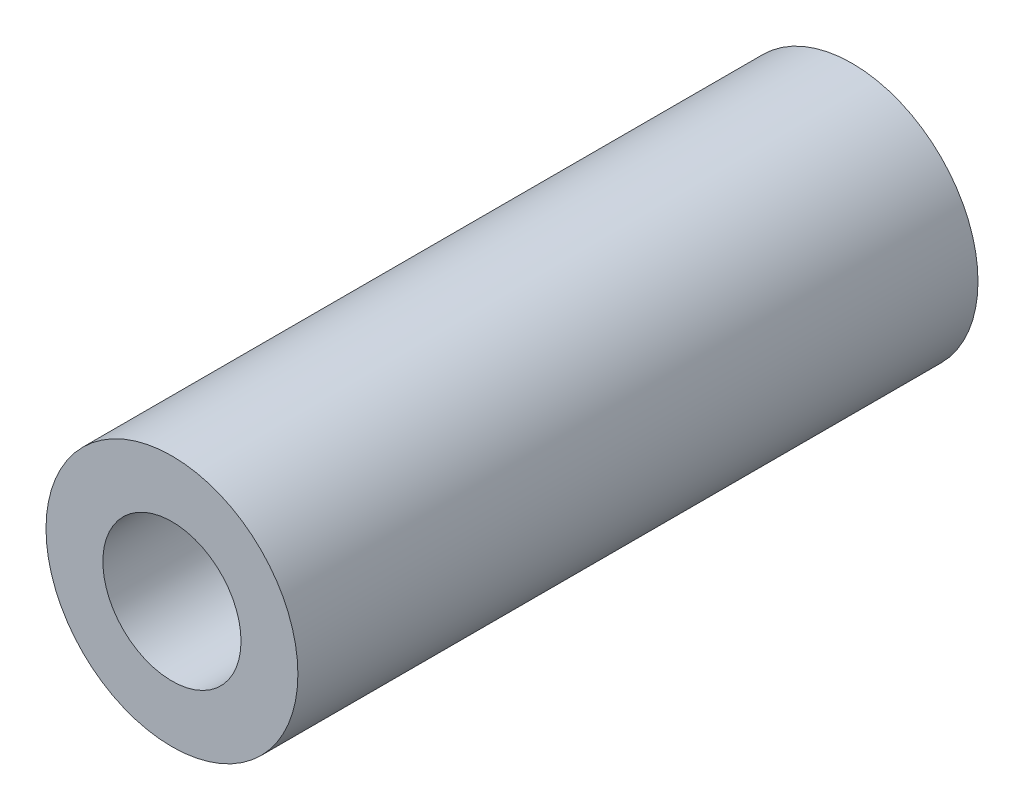
ISO-10303-21;
HEADER;
FILE_DESCRIPTION(('STEP AP214'),'2;1');
FILE_NAME('part.step','',(''),(''),'','','');
FILE_SCHEMA(('AUTOMOTIVE_DESIGN { 1 0 10303 214 1 1 1 1 }'));
ENDSEC;
DATA;
#1=APPLICATION_CONTEXT('core data for automotive mechanical design processes');
#2=APPLICATION_PROTOCOL_DEFINITION('international standard','automotive_design',2000,#1);
#3=PRODUCT_CONTEXT('',#1,'mechanical');
#4=PRODUCT('Part','Part','',(#3));
#5=PRODUCT_RELATED_PRODUCT_CATEGORY('part','',(#4));
#6=PRODUCT_DEFINITION_FORMATION('','',#4);
#7=PRODUCT_DEFINITION_CONTEXT('part definition',#1,'design');
#8=PRODUCT_DEFINITION('design','',#6,#7);
#9=PRODUCT_DEFINITION_SHAPE('','',#8);
#10=(LENGTH_UNIT() NAMED_UNIT(*) SI_UNIT(.MILLI.,.METRE.));
#11=(NAMED_UNIT(*) PLANE_ANGLE_UNIT() SI_UNIT($,.RADIAN.));
#12=(NAMED_UNIT(*) SI_UNIT($,.STERADIAN.) SOLID_ANGLE_UNIT());
#13=UNCERTAINTY_MEASURE_WITH_UNIT(LENGTH_MEASURE(1.E-05),#10,'distance_accuracy_value','');
#14=(GEOMETRIC_REPRESENTATION_CONTEXT(3) GLOBAL_UNCERTAINTY_ASSIGNED_CONTEXT((#13)) GLOBAL_UNIT_ASSIGNED_CONTEXT((#10,
#11,#12)) REPRESENTATION_CONTEXT('',''));
#15=CARTESIAN_POINT('',(0.,0.,0.));
#16=DIRECTION('',(0.,0.,1.));
#17=DIRECTION('',(1.,0.,0.));
#18=AXIS2_PLACEMENT_3D('',#15,#16,#17);
#19=CARTESIAN_POINT('',(16.0166666666667,16.0166666666667,16.74));
#20=DIRECTION('',(0.,0.,1.));
#21=DIRECTION('',(1.,0.,0.));
#22=AXIS2_PLACEMENT_3D('',#19,#20,#21);
#23=PLANE('',#22);
#24=CARTESIAN_POINT('',(16.0166666666667,16.0166666666667,16.74));
#25=DIRECTION('',(0.,0.,1.));
#26=DIRECTION('',(1.,0.,0.));
#27=AXIS2_PLACEMENT_3D('',#24,#25,#26);
#28=CIRCLE('',#27,1.7);
#29=CARTESIAN_POINT('',(17.7166666666667,16.0166666666667,16.74));
#30=VERTEX_POINT('',#29);
#31=EDGE_CURVE('E48',#30,#30,#28,.T.);
#32=ORIENTED_EDGE('',*,*,#31,.F.);
#33=EDGE_LOOP('',(#32));
#34=FACE_BOUND('',#33,.T.);
#35=CARTESIAN_POINT('',(16.0166666666667,16.0166666666667,16.74));
#36=DIRECTION('',(0.,0.,1.));
#37=DIRECTION('',(1.,0.,0.));
#38=AXIS2_PLACEMENT_3D('',#35,#36,#37);
#39=CIRCLE('',#38,3.1);
#40=CARTESIAN_POINT('',(19.1166666666667,16.0166666666667,16.74));
#41=VERTEX_POINT('',#40);
#42=EDGE_CURVE('E10',#41,#41,#39,.T.);
#43=ORIENTED_EDGE('',*,*,#42,.T.);
#44=EDGE_LOOP('',(#43));
#45=FACE_BOUND('',#44,.T.);
#46=ADVANCED_FACE('F33',(#34,#45),#23,.T.);
#47=CARTESIAN_POINT('',(16.0166666666667,16.0166666666667,0.));
#48=DIRECTION('',(0.,0.,1.));
#49=DIRECTION('',(1.,0.,0.));
#50=AXIS2_PLACEMENT_3D('',#47,#48,#49);
#51=PLANE('',#50);
#52=CARTESIAN_POINT('',(16.0166666666667,16.0166666666667,0.));
#53=DIRECTION('',(0.,0.,1.));
#54=DIRECTION('',(1.,0.,0.));
#55=AXIS2_PLACEMENT_3D('',#52,#53,#54);
#56=CIRCLE('',#55,1.7);
#57=CARTESIAN_POINT('',(17.7166666666667,16.0166666666667,0.));
#58=VERTEX_POINT('',#57);
#59=EDGE_CURVE('E44',#58,#58,#56,.T.);
#60=ORIENTED_EDGE('',*,*,#59,.T.);
#61=EDGE_LOOP('',(#60));
#62=FACE_BOUND('',#61,.T.);
#63=CARTESIAN_POINT('',(16.0166666666667,16.0166666666667,0.));
#64=DIRECTION('',(0.,0.,1.));
#65=DIRECTION('',(1.,0.,0.));
#66=AXIS2_PLACEMENT_3D('',#63,#64,#65);
#67=CIRCLE('',#66,3.1);
#68=CARTESIAN_POINT('',(19.1166666666667,16.0166666666667,0.));
#69=VERTEX_POINT('',#68);
#70=EDGE_CURVE('E37',#69,#69,#67,.T.);
#71=ORIENTED_EDGE('',*,*,#70,.F.);
#72=EDGE_LOOP('',(#71));
#73=FACE_BOUND('',#72,.T.);
#74=ADVANCED_FACE('F55',(#62,#73),#51,.F.);
#75=CARTESIAN_POINT('',(16.0166666666667,16.0166666666667,16.74));
#76=DIRECTION('',(0.,0.,-1.));
#77=DIRECTION('',(-1.,0.,0.));
#78=AXIS2_PLACEMENT_3D('',#75,#76,#77);
#79=CYLINDRICAL_SURFACE('',#78,3.1);
#80=ORIENTED_EDGE('',*,*,#42,.F.);
#81=EDGE_LOOP('',(#80));
#82=FACE_BOUND('',#81,.T.);
#83=ORIENTED_EDGE('',*,*,#70,.T.);
#84=EDGE_LOOP('',(#83));
#85=FACE_BOUND('',#84,.T.);
#86=ADVANCED_FACE('F35',(#82,#85),#79,.T.);
#87=CARTESIAN_POINT('',(16.0166666666667,16.0166666666667,16.74));
#88=DIRECTION('',(0.,0.,1.));
#89=DIRECTION('',(1.,0.,0.));
#90=AXIS2_PLACEMENT_3D('',#87,#88,#89);
#91=CYLINDRICAL_SURFACE('',#90,1.7);
#92=ORIENTED_EDGE('',*,*,#59,.F.);
#93=EDGE_LOOP('',(#92));
#94=FACE_BOUND('',#93,.T.);
#95=ORIENTED_EDGE('',*,*,#31,.T.);
#96=EDGE_LOOP('',(#95));
#97=FACE_BOUND('',#96,.T.);
#98=ADVANCED_FACE('F52',(#94,#97),#91,.F.);
#99=CLOSED_SHELL('',(#46,#74,#86,#98));
#100=MANIFOLD_SOLID_BREP('B2',#99);
#101=ADVANCED_BREP_SHAPE_REPRESENTATION('',(#18,#100),#14);
#102=SHAPE_DEFINITION_REPRESENTATION(#9,#101);
ENDSEC;
END-ISO-10303-21;
